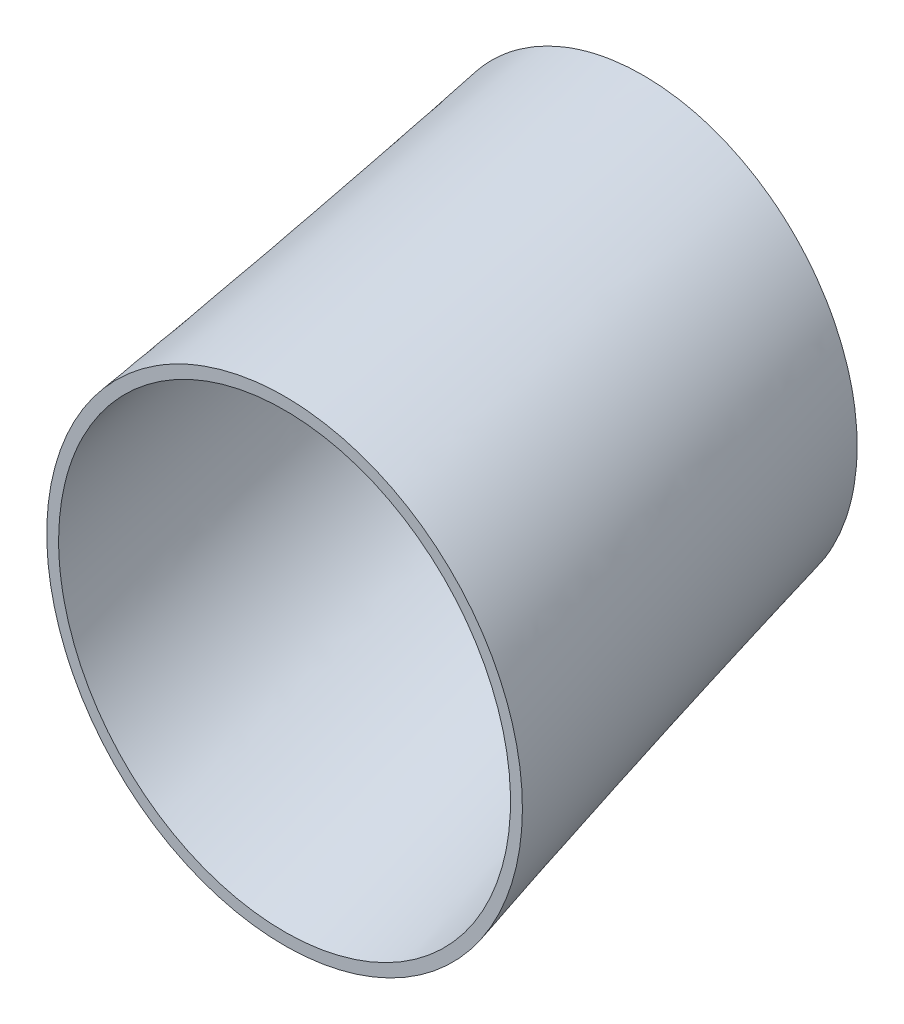
ISO-10303-21;
HEADER;
FILE_DESCRIPTION(('STEP AP214'),'2;1');
FILE_NAME('part.step','',(''),(''),'','','');
FILE_SCHEMA(('AUTOMOTIVE_DESIGN { 1 0 10303 214 1 1 1 1 }'));
ENDSEC;
DATA;
#1=APPLICATION_CONTEXT('core data for automotive mechanical design processes');
#2=APPLICATION_PROTOCOL_DEFINITION('international standard','automotive_design',2000,#1);
#3=PRODUCT_CONTEXT('',#1,'mechanical');
#4=PRODUCT('Part','Part','',(#3));
#5=PRODUCT_RELATED_PRODUCT_CATEGORY('part','',(#4));
#6=PRODUCT_DEFINITION_FORMATION('','',#4);
#7=PRODUCT_DEFINITION_CONTEXT('part definition',#1,'design');
#8=PRODUCT_DEFINITION('design','',#6,#7);
#9=PRODUCT_DEFINITION_SHAPE('','',#8);
#10=(LENGTH_UNIT() NAMED_UNIT(*) SI_UNIT(.MILLI.,.METRE.));
#11=(NAMED_UNIT(*) PLANE_ANGLE_UNIT() SI_UNIT($,.RADIAN.));
#12=(NAMED_UNIT(*) SI_UNIT($,.STERADIAN.) SOLID_ANGLE_UNIT());
#13=UNCERTAINTY_MEASURE_WITH_UNIT(LENGTH_MEASURE(1.E-05),#10,'distance_accuracy_value','');
#14=(GEOMETRIC_REPRESENTATION_CONTEXT(3) GLOBAL_UNCERTAINTY_ASSIGNED_CONTEXT((#13)) GLOBAL_UNIT_ASSIGNED_CONTEXT((#10,
#11,#12)) REPRESENTATION_CONTEXT('',''));
#15=CARTESIAN_POINT('',(0.,0.,0.));
#16=DIRECTION('',(0.,0.,1.));
#17=DIRECTION('',(1.,0.,0.));
#18=AXIS2_PLACEMENT_3D('',#15,#16,#17);
#19=CARTESIAN_POINT('',(2.8764045873989E-13,28.170605725546,0.));
#20=DIRECTION('',(0.,0.,1.));
#21=DIRECTION('',(1.,0.,0.));
#22=AXIS2_PLACEMENT_3D('',#19,#20,#21);
#23=PLANE('',#22);
#24=CARTESIAN_POINT('',(2.8764045873989E-13,28.170605725546,0.));
#25=DIRECTION('',(0.,0.,-1.));
#26=DIRECTION('',(-1.,0.,0.));
#27=AXIS2_PLACEMENT_3D('',#24,#25,#26);
#28=CIRCLE('',#27,8.5);
#29=CARTESIAN_POINT('',(8.36217269118516,26.6461163412595,0.));
#30=VERTEX_POINT('',#29);
#31=EDGE_CURVE('E139',#30,#30,#28,.T.);
#32=ORIENTED_EDGE('',*,*,#31,.F.);
#33=EDGE_LOOP('',(#32));
#34=FACE_BOUND('',#33,.T.);
#35=CARTESIAN_POINT('',(2.8764045873989E-13,28.170605725546,0.));
#36=DIRECTION('',(0.,0.,1.));
#37=DIRECTION('',(1.,0.,0.));
#38=AXIS2_PLACEMENT_3D('',#35,#36,#37);
#39=CIRCLE('',#38,9.);
#40=CARTESIAN_POINT('',(-0.079167113899448,19.170953922944,0.));
#41=VERTEX_POINT('',#40);
#42=EDGE_CURVE('E13',#41,#41,#39,.T.);
#43=ORIENTED_EDGE('',*,*,#42,.F.);
#44=EDGE_LOOP('',(#43));
#45=FACE_BOUND('',#44,.T.);
#46=ADVANCED_FACE('F70',(#34,#45),#23,.F.);
#47=CARTESIAN_POINT('',(0.500000000000292,23.5132768769378,15.5748036148368));
#48=DIRECTION('',(0.,0.,-1.));
#49=DIRECTION('',(-1.,0.,0.));
#50=AXIS2_PLACEMENT_3D('',#47,#48,#49);
#51=PLANE('',#50);
#52=CARTESIAN_POINT('',(0.500000000000292,23.5132768769378,15.5748036148368));
#53=DIRECTION('',(0.,0.,1.));
#54=DIRECTION('',(1.,0.,0.));
#55=AXIS2_PLACEMENT_3D('',#52,#53,#54);
#56=CIRCLE('',#55,9.5);
#57=CARTESIAN_POINT('',(9.92967534082972,22.3594905160575,15.5748036148368));
#58=VERTEX_POINT('',#57);
#59=EDGE_CURVE('E85',#58,#58,#56,.T.);
#60=ORIENTED_EDGE('',*,*,#59,.F.);
#61=EDGE_LOOP('',(#60));
#62=FACE_BOUND('',#61,.T.);
#63=CARTESIAN_POINT('',(0.500000000000292,23.5132768769378,15.5748036148368));
#64=DIRECTION('',(0.,0.,-1.));
#65=DIRECTION('',(-1.,0.,0.));
#66=AXIS2_PLACEMENT_3D('',#63,#64,#65);
#67=CIRCLE('',#66,10.);
#68=CARTESIAN_POINT('',(2.8283435977617,13.7881128119586,15.5748036148368));
#69=VERTEX_POINT('',#68);
#70=EDGE_CURVE('E79',#69,#69,#67,.T.);
#71=ORIENTED_EDGE('',*,*,#70,.F.);
#72=EDGE_LOOP('',(#71));
#73=FACE_BOUND('',#72,.T.);
#74=ADVANCED_FACE('F102',(#62,#73),#51,.F.);
#75=CARTESIAN_POINT('',(2.8283435977617,13.7881128119586,15.5748036148368));
#76=CARTESIAN_POINT('',(-0.079167113899448,19.170953922944,0.));
#77=CARTESIAN_POINT('',(2.42312842838756,13.6910984953852,15.5748036148368));
#78=CARTESIAN_POINT('',(-0.454152605674531,19.1742525526898,0.));
#79=CARTESIAN_POINT('',(1.98631808591908,13.6130940366696,15.5748036148368));
#80=CARTESIAN_POINT('',(-0.852603191945034,19.2010179539182,0.));
#81=CARTESIAN_POINT('',(1.04725752425121,13.5171140668681,15.5748036148368));
#82=CARTESIAN_POINT('',(-1.6936179371836,19.3211935824317,0.));
#83=CARTESIAN_POINT('',(0.544862246843895,13.4991652426862,15.5748036148368));
#84=CARTESIAN_POINT('',(-2.13630299067969,19.4146586304561,0.));
#85=CARTESIAN_POINT('',(-0.520534415529787,13.5512010916828,15.5748036148368));
#86=CARTESIAN_POINT('',(-3.05550287746433,19.6915549434238,0.));
#87=CARTESIAN_POINT('',(-1.08370650811184,13.6213116838705,15.5748036148368));
#88=CARTESIAN_POINT('',(-3.53213944978028,19.875133269326,0.));
#89=CARTESIAN_POINT('',(-2.25368474387135,13.8812302607684,15.5748036148368));
#90=CARTESIAN_POINT('',(-4.49751873928556,20.3563112881464,0.));
#91=CARTESIAN_POINT('',(-2.86061440006878,14.0713112289123,15.5748036148368));
#92=CARTESIAN_POINT('',(-4.98631002776457,20.6541762336255,0.));
#93=CARTESIAN_POINT('',(-4.08423272148748,14.6009677036828,15.5748036148368));
#94=CARTESIAN_POINT('',(-5.9399395175968,21.382592869983,0.));
#95=CARTESIAN_POINT('',(-4.70086225652519,14.9409493745797,15.5748036148368));
#96=CARTESIAN_POINT('',(-6.40463783946228,21.8134864541508,0.));
#97=CARTESIAN_POINT('',(-5.89156324707177,15.7878845711896,15.5748036148368));
#98=CARTESIAN_POINT('',(-7.26059149232606,22.8118593733683,0.));
#99=CARTESIAN_POINT('',(-6.46526004138084,16.2952230827401,15.5748036148368));
#100=CARTESIAN_POINT('',(-7.65143596379708,23.3795935581536,0.));
#101=CARTESIAN_POINT('',(-7.50541198127708,17.4693934374584,15.5748036148368));
#102=CARTESIAN_POINT('',(-8.30481273622909,24.6310640444301,0.));
#103=CARTESIAN_POINT('',(-7.9712107428854,18.1363046956592,15.5748036148368));
#104=CARTESIAN_POINT('',(-8.56675450727207,25.3147271118938,0.));
#105=CARTESIAN_POINT('',(-8.73438428879122,19.5890714674891,15.5748036148368));
#106=CARTESIAN_POINT('',(-8.91769895076796,26.749348934092,0.));
#107=CARTESIAN_POINT('',(-9.03113543183216,20.3745029404281,15.5748036148368));
#108=CARTESIAN_POINT('',(-9.00624906209332,27.4998018558955,0.));
#109=CARTESIAN_POINT('',(-9.41919269812573,21.9953636179247,15.5748036148368));
#110=CARTESIAN_POINT('',(-8.99305454311003,28.9997438229958,0.));
#111=CARTESIAN_POINT('',(-9.51031512563101,22.8300255511556,15.5748036148368));
#112=CARTESIAN_POINT('',(-8.89131615872753,29.7485228365923,0.));
#113=CARTESIAN_POINT('',(-9.48780283307224,24.47089676828,15.5748036148368));
#114=CARTESIAN_POINT('',(-8.51518814101123,31.176748830417,0.));
#115=CARTESIAN_POINT('',(-9.37453210127932,25.2764455588258,15.5748036148368));
#116=CARTESIAN_POINT('',(-8.24125989738917,31.8556980174532,0.));
#117=CARTESIAN_POINT('',(-8.97890434069419,26.7943621425101,15.5748036148368));
#118=CARTESIAN_POINT('',(-7.56596835294338,33.0954806253224,0.));
#119=CARTESIAN_POINT('',(-8.69716849303885,27.5065034832907,15.5748036148368));
#120=CARTESIAN_POINT('',(-7.16519677898618,33.65625121207,0.));
#121=CARTESIAN_POINT('',(-8.01911962384838,28.8008441676295,15.5748036148368));
#122=CARTESIAN_POINT('',(-6.29181219843573,34.6394116853063,0.));
#123=CARTESIAN_POINT('',(-7.62331499008481,29.3832170824512,15.5748036148368));
#124=CARTESIAN_POINT('',(-5.8196055044692,35.0620636099379,0.));
#125=CARTESIAN_POINT('',(-6.77223164430793,30.4095868580775,15.5748036148368));
#126=CARTESIAN_POINT('',(-4.85330927641301,35.7735912619968,0.));
#127=CARTESIAN_POINT('',(-6.31718959117013,30.8539190670142,15.5748036148368));
#128=CARTESIAN_POINT('',(-4.35935358557392,36.0628112905665,0.));
#129=CARTESIAN_POINT('',(-5.3917741471462,31.6155049090107,15.5748036148368));
#130=CARTESIAN_POINT('',(-3.38565880070635,36.5269318830028,0.));
#131=CARTESIAN_POINT('',(-4.92141426111187,31.9330578630356,15.5748036148368));
#132=CARTESIAN_POINT('',(-2.90586647657864,36.7020968039152,0.));
#133=CARTESIAN_POINT('',(-3.99509732297781,32.4619384808538,15.5748036148368));
#134=CARTESIAN_POINT('',(-1.98193767419039,36.9627796919563,0.));
#135=CARTESIAN_POINT('',(-3.53904509701081,32.6734557194922,15.5748036148368));
#136=CARTESIAN_POINT('',(-1.53767688864368,37.0484425556515,0.));
#137=CARTESIAN_POINT('',(-2.65833444146587,33.0131550487419,15.5748036148368));
#138=CARTESIAN_POINT('',(-0.694678160599266,37.1538044458813,0.));
#139=CARTESIAN_POINT('',(-2.23355876713525,33.1414266253437,15.5748036148368));
#140=CARTESIAN_POINT('',(-0.295818377875057,37.1735561578937,0.));
#141=CARTESIAN_POINT('',(-1.42312842838698,33.3354552584904,15.5748036148368));
#142=CARTESIAN_POINT('',(0.454152605675106,37.1669588984021,0.));
#143=CARTESIAN_POINT('',(-0.986318085918497,33.413459717206,15.5748036148368));
#144=CARTESIAN_POINT('',(0.852603191945605,37.1401934971737,0.));
#145=CARTESIAN_POINT('',(-0.0472575242506278,33.5094396870076,15.5748036148368));
#146=CARTESIAN_POINT('',(1.69361793718417,37.0200178686602,0.));
#147=CARTESIAN_POINT('',(0.455137753156695,33.5273885111894,15.5748036148368));
#148=CARTESIAN_POINT('',(2.13630299068027,36.9265528206358,0.));
#149=CARTESIAN_POINT('',(1.52053441553037,33.4753526621928,15.5748036148368));
#150=CARTESIAN_POINT('',(3.0555028774649,36.6496565076681,0.));
#151=CARTESIAN_POINT('',(2.08370650811243,33.4052420700051,15.5748036148368));
#152=CARTESIAN_POINT('',(3.53213944978085,36.4660781817659,0.));
#153=CARTESIAN_POINT('',(3.25368474387193,33.1453234931072,15.5748036148368));
#154=CARTESIAN_POINT('',(4.49751873928614,35.9849001629455,0.));
#155=CARTESIAN_POINT('',(3.86061440006936,32.9552425249633,15.5748036148368));
#156=CARTESIAN_POINT('',(4.98631002776515,35.6870352174664,0.));
#157=CARTESIAN_POINT('',(5.08423272148806,32.4255860501928,15.5748036148368));
#158=CARTESIAN_POINT('',(5.93993951759737,34.9586185811089,0.));
#159=CARTESIAN_POINT('',(5.70086225652577,32.0856043792959,15.5748036148368));
#160=CARTESIAN_POINT('',(6.40463783946286,34.5277249969411,0.));
#161=CARTESIAN_POINT('',(6.89156324707236,31.238669182686,15.5748036148368));
#162=CARTESIAN_POINT('',(7.26059149232663,33.5293520777237,0.));
#163=CARTESIAN_POINT('',(7.46526004138143,30.7313306711355,15.5748036148368));
#164=CARTESIAN_POINT('',(7.65143596379766,32.9616178929384,0.));
#165=CARTESIAN_POINT('',(8.50541198127766,29.5571603164172,15.5748036148368));
#166=CARTESIAN_POINT('',(8.30481273622967,31.7101474066617,0.));
#167=CARTESIAN_POINT('',(8.97121074288599,28.8902490582164,15.5748036148368));
#168=CARTESIAN_POINT('',(8.56675450727264,31.0264843391981,0.));
#169=CARTESIAN_POINT('',(9.73438428879181,27.4374822863865,15.5748036148368));
#170=CARTESIAN_POINT('',(8.91769895076853,29.5918625169999,0.));
#171=CARTESIAN_POINT('',(10.0311354318327,26.6520508134475,15.5748036148368));
#172=CARTESIAN_POINT('',(9.00624906209389,28.8414095951964,0.));
#173=CARTESIAN_POINT('',(10.4191926981263,25.0311901359509,15.5748036148368));
#174=CARTESIAN_POINT('',(8.9930545431106,27.3414676280961,0.));
#175=CARTESIAN_POINT('',(10.5103151256316,24.19652820272,15.5748036148368));
#176=CARTESIAN_POINT('',(8.8913161587281,26.5926886144996,0.));
#177=CARTESIAN_POINT('',(10.4878028330728,22.5556569855956,15.5748036148368));
#178=CARTESIAN_POINT('',(8.5151881410118,25.1644626206749,0.));
#179=CARTESIAN_POINT('',(10.3745321012799,21.7501081950498,15.5748036148368));
#180=CARTESIAN_POINT('',(8.24125989738974,24.4855134336387,0.));
#181=CARTESIAN_POINT('',(9.97890434069478,20.2321916113655,15.5748036148368));
#182=CARTESIAN_POINT('',(7.56596835294396,23.2457308257694,0.));
#183=CARTESIAN_POINT('',(9.69716849303944,19.520050270585,15.5748036148368));
#184=CARTESIAN_POINT('',(7.16519677898676,22.6849602390219,0.));
#185=CARTESIAN_POINT('',(9.01911962384897,18.2257095862461,15.5748036148368));
#186=CARTESIAN_POINT('',(6.2918121984363,21.7017997657856,0.));
#187=CARTESIAN_POINT('',(8.62331499008539,17.6433366714244,15.5748036148368));
#188=CARTESIAN_POINT('',(5.81960550446977,21.279147841154,0.));
#189=CARTESIAN_POINT('',(7.77223164430852,16.6169668957981,15.5748036148368));
#190=CARTESIAN_POINT('',(4.85330927641358,20.5676201890951,0.));
#191=CARTESIAN_POINT('',(7.31718959117071,16.1726346868614,15.5748036148368));
#192=CARTESIAN_POINT('',(4.35935358557449,20.2784001605254,0.));
#193=CARTESIAN_POINT('',(6.39177414714678,15.4110488448649,15.5748036148368));
#194=CARTESIAN_POINT('',(3.38565880070693,19.8142795680891,0.));
#195=CARTESIAN_POINT('',(5.92141426111246,15.09349589084,15.5748036148368));
#196=CARTESIAN_POINT('',(2.90586647657921,19.6391146471767,0.));
#197=CARTESIAN_POINT('',(4.9950973229784,14.5646152730218,15.5748036148368));
#198=CARTESIAN_POINT('',(1.98193767419097,19.3784317591356,0.));
#199=CARTESIAN_POINT('',(4.5390450970114,14.3530980343834,15.5748036148368));
#200=CARTESIAN_POINT('',(1.53767688864425,19.2927688954404,0.));
#201=CARTESIAN_POINT('',(3.65833444146646,14.0133987051337,15.5748036148368));
#202=CARTESIAN_POINT('',(0.69467816059984,19.1874070052106,0.));
#203=CARTESIAN_POINT('',(3.23355876713583,13.885127128532,15.5748036148368));
#204=CARTESIAN_POINT('',(0.295818377875635,19.1676552931982,0.));
#205=CARTESIAN_POINT('',(2.8283435977617,13.7881128119586,15.5748036148368));
#206=CARTESIAN_POINT('',(-0.079167113899448,19.170953922944,0.));
#207=B_SPLINE_SURFACE_WITH_KNOTS('',3,1,((#75,#76),(#77,#78),(#79,#80),(#81,#82),(#83,#84),(#85,
#86),(#87,#88),(#89,#90),(#91,#92),(#93,#94),(#95,#96),(#97,#98),(#99,#100),(#101,#102),(#103,
#104),(#105,#106),(#107,#108),(#109,#110),(#111,#112),(#113,#114),(#115,#116),(#117,#118),(#119,
#120),(#121,#122),(#123,#124),(#125,#126),(#127,#128),(#129,#130),(#131,#132),(#133,#134),(#135,
#136),(#137,#138),(#139,#140),(#141,#142),(#143,#144),(#145,#146),(#147,#148),(#149,#150),(#151,
#152),(#153,#154),(#155,#156),(#157,#158),(#159,#160),(#161,#162),(#163,#164),(#165,#166),(#167,
#168),(#169,#170),(#171,#172),(#173,#174),(#175,#176),(#177,#178),(#179,#180),(#181,#182),(#183,
#184),(#185,#186),(#187,#188),(#189,#190),(#191,#192),(#193,#194),(#195,#196),(#197,#198),(#199,
#200),(#201,#202),(#203,#204),(#205,#206)),.UNSPECIFIED.,.T.,.F.,.F.,(4,2,2,2,2,2,2,2,2,2,2,2,2,
2,2,2,2,2,2,2,2,2,2,2,2,2,2,2,2,2,2,2,4),(2,2),(0.,0.03125,0.0625000000000001,
0.0937500000000001,0.125,0.15625,0.1875,0.21875,0.25,0.28125,0.3125,0.34375,0.375,0.40625,
0.4375,0.46875,0.5,0.53125,0.5625,0.593750000000001,0.625000000000001,0.656250000000001,0.6875,
0.71875,0.75,0.78125,0.8125,0.84375,0.875,0.90625,0.9375,0.96875,1.),(0.,1.),.UNSPECIFIED.);
#208=CARTESIAN_POINT('',(2.8283435977617,13.7881128119586,15.5748036148368));
#209=CARTESIAN_POINT('',(2.79805702784856,13.8441840735313,15.4125660771822));
#210=CARTESIAN_POINT('',(2.76777045793542,13.9002553351041,15.2503285395277));
#211=CARTESIAN_POINT('',(2.70719731810915,14.0123978582496,14.9258534642186));
#212=CARTESIAN_POINT('',(2.67691074819601,14.0684691198224,14.763615926564));
#213=CARTESIAN_POINT('',(2.61633760836974,14.1806116429679,14.4391408512549));
#214=CARTESIAN_POINT('',(2.5860510384566,14.2366829045407,14.2769033136004));
#215=CARTESIAN_POINT('',(2.52547789863033,14.3488254276862,13.9524282382913));
#216=CARTESIAN_POINT('',(2.49519132871719,14.404896689259,13.7901907006367));
#217=CARTESIAN_POINT('',(2.43461818889092,14.5170392124045,13.4657156253276));
#218=CARTESIAN_POINT('',(2.40433161897778,14.5731104739773,13.3034780876731));
#219=CARTESIAN_POINT('',(2.34375847915151,14.6852529971228,12.979003012364));
#220=CARTESIAN_POINT('',(2.31347190923837,14.7413242586956,12.8167654747094));
#221=CARTESIAN_POINT('',(2.25289876941209,14.8534667818411,12.4922903994003));
#222=CARTESIAN_POINT('',(2.22261219949896,14.9095380434139,12.3300528617458));
#223=CARTESIAN_POINT('',(2.16203905967268,15.0216805665594,12.0055777864367));
#224=CARTESIAN_POINT('',(2.13175248975955,15.0777518281322,11.8433402487821));
#225=CARTESIAN_POINT('',(2.07117934993327,15.1898943512777,11.518865173473));
#226=CARTESIAN_POINT('',(2.04089278002014,15.2459656128505,11.3566276358185));
#227=CARTESIAN_POINT('',(1.98031964019386,15.358108135996,11.0321525605094));
#228=CARTESIAN_POINT('',(1.95003307028073,15.4141793975687,10.8699150228548));
#229=CARTESIAN_POINT('',(1.88945993045445,15.5263219207143,10.5454399475457));
#230=CARTESIAN_POINT('',(1.85917336054132,15.582393182287,10.3832024098912));
#231=CARTESIAN_POINT('',(1.79860022071504,15.6945357054326,10.0587273345821));
#232=CARTESIAN_POINT('',(1.7683136508019,15.7506069670053,9.89648979692753));
#233=CARTESIAN_POINT('',(1.70774051097563,15.8627494901509,9.57201472161843));
#234=CARTESIAN_POINT('',(1.67745394106249,15.9188207517236,9.40977718396388));
#235=CARTESIAN_POINT('',(1.61688080123622,16.0309632748692,9.08530210865478));
#236=CARTESIAN_POINT('',(1.58659423132308,16.0870345364419,8.92306457100023));
#237=CARTESIAN_POINT('',(1.52602109149681,16.1991770595875,8.59858949569113));
#238=CARTESIAN_POINT('',(1.49573452158367,16.2552483211602,8.43635195803659));
#239=CARTESIAN_POINT('',(1.4351613817574,16.3673908443057,8.11187688272748));
#240=CARTESIAN_POINT('',(1.40487481184426,16.4234621058785,7.94963934507294));
#241=CARTESIAN_POINT('',(1.34430167201799,16.535604629024,7.62516426976384));
#242=CARTESIAN_POINT('',(1.31401510210485,16.5916758905968,7.46292673210929));
#243=CARTESIAN_POINT('',(1.25344196227858,16.7038184137423,7.13845165680019));
#244=CARTESIAN_POINT('',(1.22315539236544,16.7598896753151,6.97621411914564));
#245=CARTESIAN_POINT('',(1.16258225253917,16.8720321984606,6.65173904383654));
#246=CARTESIAN_POINT('',(1.13229568262603,16.9281034600334,6.48950150618199));
#247=CARTESIAN_POINT('',(1.07172254279975,17.0402459831789,6.16502643087289));
#248=CARTESIAN_POINT('',(1.04143597288662,17.0963172447517,6.00278889321834));
#249=CARTESIAN_POINT('',(0.980862833060344,17.2084597678972,5.67831381790924));
#250=CARTESIAN_POINT('',(0.950576263147207,17.26453102947,5.51607628025469));
#251=CARTESIAN_POINT('',(0.890003123320933,17.3766735526155,5.19160120494559));
#252=CARTESIAN_POINT('',(0.859716553407797,17.4327448141883,5.02936366729104));
#253=CARTESIAN_POINT('',(0.799143413581523,17.5448873373338,4.70488859198194));
#254=CARTESIAN_POINT('',(0.768856843668386,17.6009585989066,4.54265105432739));
#255=CARTESIAN_POINT('',(0.708283703842112,17.7131011220521,4.21817597901829));
#256=CARTESIAN_POINT('',(0.677997133928975,17.7691723836249,4.05593844136374));
#257=CARTESIAN_POINT('',(0.617423994102701,17.8813149067704,3.73146336605464));
#258=CARTESIAN_POINT('',(0.587137424189564,17.9373861683432,3.56922582840009));
#259=CARTESIAN_POINT('',(0.52656428436329,18.0495286914887,3.24475075309099));
#260=CARTESIAN_POINT('',(0.496277714450153,18.1055999530615,3.08251321543644));
#261=CARTESIAN_POINT('',(0.435704574623879,18.217742476207,2.75803814012734));
#262=CARTESIAN_POINT('',(0.405418004710743,18.2738137377798,2.5958006024728));
#263=CARTESIAN_POINT('',(0.344844864884469,18.3859562609253,2.2713255271637));
#264=CARTESIAN_POINT('',(0.314558294971332,18.4420275224981,2.10908798950915));
#265=CARTESIAN_POINT('',(0.253985155145058,18.5541700456436,1.78461291420005));
#266=CARTESIAN_POINT('',(0.223698585231921,18.6102413072163,1.6223753765455));
#267=CARTESIAN_POINT('',(0.163125445405647,18.7223838303619,1.2979003012364));
#268=CARTESIAN_POINT('',(0.13283887549251,18.7784550919346,1.13566276358185));
#269=CARTESIAN_POINT('',(0.0722657356662367,18.8905976150802,0.811187688272749));
#270=CARTESIAN_POINT('',(0.0419791657530997,18.9466688766529,0.648950150618199));
#271=CARTESIAN_POINT('',(-0.0185939740731743,19.0588113997985,0.324475075309099));
#272=CARTESIAN_POINT('',(-0.0488805439863113,19.1148826613712,0.162237537654549));
#273=CARTESIAN_POINT('',(-0.079167113899448,19.170953922944,0.));
#274=B_SPLINE_CURVE_WITH_KNOTS('',3,(#208,#209,#210,#211,#212,#213,#214,#215,#216,#217,#218,
#219,#220,#221,#222,#223,#224,#225,#226,#227,#228,#229,#230,#231,#232,#233,#234,#235,#236,#237,
#238,#239,#240,#241,#242,#243,#244,#245,#246,#247,#248,#249,#250,#251,#252,#253,#254,#255,#256,
#257,#258,#259,#260,#261,#262,#263,#264,#265,#266,#267,#268,#269,#270,#271,#272,#273),
.UNSPECIFIED.,.F.,.F.,(4,2,2,2,2,2,2,2,2,2,2,2,2,2,2,2,2,2,2,2,2,2,2,2,2,2,2,2,2,2,2,2,4),(0.,
0.522915415570325,1.04583083114065,1.56874624671097,2.0916616622813,2.61457707785163,
3.13749249342195,3.66040790899227,4.1833233245626,4.70623874013292,5.22915415570325,
5.75206957127358,6.2749849868439,6.79790040241422,7.32081581798455,7.84373123355487,
8.3666466491252,8.88956206469552,9.41247748026585,9.93539289583617,10.4583083114065,
10.9812237269768,11.5041391425471,12.0270545581175,12.5499699736878,13.0728853892581,
13.5958008048284,14.1187162203988,14.6416316359691,15.1645470515394,15.6874624671098,
16.2103778826801,16.7332932982504),.UNSPECIFIED.);
#275=EDGE_CURVE('BSEAM111',#69,#41,#274,.T.);
#276=ORIENTED_EDGE('',*,*,#70,.T.);
#277=ORIENTED_EDGE('',*,*,#42,.T.);
#278=ORIENTED_EDGE('',*,*,#275,.T.);
#279=ORIENTED_EDGE('',*,*,#275,.F.);
#280=EDGE_LOOP('',(#276,#278,#277,#279));
#281=FACE_BOUND('',#280,.T.);
#282=ADVANCED_FACE('F111',(#281),#207,.T.);
#283=CARTESIAN_POINT('',(8.36217269118516,26.6461163412595,0.));
#284=CARTESIAN_POINT('',(9.92967534082972,22.3594905160575,15.5748036148368));
#285=CARTESIAN_POINT('',(8.42569308219709,26.9945402033922,0.));
#286=CARTESIAN_POINT('',(9.97774977253307,22.7523936552587,15.5748036148368));
#287=CARTESIAN_POINT('',(8.47219624004174,27.3696827106544,0.));
#288=CARTESIAN_POINT('',(10.004488837779,23.1730793052364,15.5748036148368));
#289=CARTESIAN_POINT('',(8.51003173236863,28.171210269076,0.));
#290=CARTESIAN_POINT('',(9.99427989825874,24.0697763547249,15.5748036148368));
#291=CARTESIAN_POINT('',(8.50136406685087,28.5975953202354,0.));
#292=CARTESIAN_POINT('',(9.95729113165569,24.545921812152,15.5748036148368));
#293=CARTESIAN_POINT('',(8.40772155542507,29.4994132200901,0.));
#294=CARTESIAN_POINT('',(9.79380588483039,25.5459803196979,15.5748036148368));
#295=CARTESIAN_POINT('',(8.32206228126512,29.9741384682316,0.));
#296=CARTESIAN_POINT('',(9.66717222264533,26.0700409862759,15.5748036148368));
#297=CARTESIAN_POINT('',(8.04712651158849,30.9550636393389,0.));
#298=CARTESIAN_POINT('',(9.29623666141562,27.1464999456204,15.5748036148368));
#299=CARTESIAN_POINT('',(7.85761259067216,31.4613557139264,0.));
#300=CARTESIAN_POINT('',(9.05166383024492,27.6989855201184,15.5748036148368));
#301=CARTESIAN_POINT('',(7.35125097636791,32.475279951729,0.));
#302=CARTESIAN_POINT('',(8.42036034813914,28.797120465344,15.5748036148368));
#303=CARTESIAN_POINT('',(7.03406130509668,32.9828430666794,0.));
#304=CARTESIAN_POINT('',(8.033252659935,29.3426704214042,15.5748036148368));
#305=CARTESIAN_POINT('',(6.25994431990737,33.9540946191911,0.));
#306=CARTESIAN_POINT('',(7.10599846905819,30.3756750700978,15.5748036148368));
#307=CARTESIAN_POINT('',(5.80270765646679,34.4174471912812,0.));
#308=CARTESIAN_POINT('',(6.56552879127302,30.8627347868986,15.5748036148368));
#309=CARTESIAN_POINT('',(4.75784790750733,35.2457260590438,0.));
#310=CARTESIAN_POINT('',(5.34555334282643,31.718505934671,15.5748036148368));
#311=CARTESIAN_POINT('',(4.17018790317918,35.6100915735877,0.));
#312=CARTESIAN_POINT('',(4.66604307234532,32.0865892696103,15.5748036148368));
#313=CARTESIAN_POINT('',(2.90173807432915,36.1903521666139,0.));
#314=CARTESIAN_POINT('',(3.21282911807776,32.6510095519013,15.5748036148368));
#315=CARTESIAN_POINT('',(2.22133710855211,36.405737634707,0.));
#316=CARTESIAN_POINT('',(2.43959263928307,32.8468033543605,15.5748036148368));
#317=CARTESIAN_POINT('',(0.827641660021297,36.6598191987547,0.));
#318=CARTESIAN_POINT('',(0.867980082478165,33.0391010811739,15.5748036148368));
#319=CARTESIAN_POINT('',(0.115006914757961,36.6983950194128,0.));
#320=CARTESIAN_POINT('',(0.0703479630747258,33.0355139770184,15.5748036148368));
#321=CARTESIAN_POINT('',(-1.27660481780089,36.60308442224,0.));
#322=CARTESIAN_POINT('',(-1.47607918516061,32.8381206459754,15.5748036148368));
#323=CARTESIAN_POINT('',(-1.95503812832274,36.4695376062911,0.));
#324=CARTESIAN_POINT('',(-2.22428983735498,32.6447288956545,15.5748036148368));
#325=CARTESIAN_POINT('',(-3.22496666758054,36.0632627203378,0.));
#326=CARTESIAN_POINT('',(-3.61460514069509,32.1083449758074,15.5748036148368));
#327=CARTESIAN_POINT('',(-3.81629854760907,35.7910723823045,0.));
#328=CARTESIAN_POINT('',(-4.25656272226839,31.7659634579128,15.5748036148368));
#329=CARTESIAN_POINT('',(-4.88335550831147,35.1554812184016,0.));
#330=CARTESIAN_POINT('',(-5.40552403146786,30.9869982156306,15.5748036148368));
#331=CARTESIAN_POINT('',(-5.35925151423309,34.7925038158444,0.));
#332=CARTESIAN_POINT('',(-5.9127461699216,30.5508757338821,15.5748036148368));
#333=CARTESIAN_POINT('',(-6.19083753051843,34.0224978795276,0.));
#334=CARTESIAN_POINT('',(-6.79019074234852,29.6373466063974,15.5748036148368));
#335=CARTESIAN_POINT('',(-6.54682315170398,33.6156546314327,0.));
#336=CARTESIAN_POINT('',(-7.16075512139285,29.1601273478183,15.5748036148368));
#337=CARTESIAN_POINT('',(-7.15022694509589,32.7948576218866,0.));
#338=CARTESIAN_POINT('',(-7.78028665820255,28.2048589265691,15.5748036148368));
#339=CARTESIAN_POINT('',(-7.39789978727317,32.3809014216427,0.));
#340=CARTESIAN_POINT('',(-8.02953779938268,27.7267903799431,15.5748036148368));
#341=CARTESIAN_POINT('',(-7.8037577246008,31.5701463543427,0.));
#342=CARTESIAN_POINT('',(-8.42931849291626,26.7956513776872,15.5748036148368));
#343=CARTESIAN_POINT('',(-7.96233351290672,31.174251090869,0.));
#344=CARTESIAN_POINT('',(-8.58001677121747,26.3424707355583,15.5748036148368));
#345=CARTESIAN_POINT('',(-8.20978080069265,30.4109373996802,0.));
#346=CARTESIAN_POINT('',(-8.80612203868799,25.4746883728489,15.5748036148368));
#347=CARTESIAN_POINT('',(-8.29865230017264,30.0435189719651,0.));
#348=CARTESIAN_POINT('',(-8.88160090912578,25.0599663770193,15.5748036148368));
#349=CARTESIAN_POINT('',(-8.42569308219651,29.3466712476997,0.));
#350=CARTESIAN_POINT('',(-8.97774977253249,24.2741600986169,15.5748036148368));
#351=CARTESIAN_POINT('',(-8.47219624004116,28.9715287404376,0.));
#352=CARTESIAN_POINT('',(-9.00448883777843,23.8534744486392,15.5748036148368));
#353=CARTESIAN_POINT('',(-8.51003173236806,28.170001182016,0.));
#354=CARTESIAN_POINT('',(-8.99427989825816,22.9567773991507,15.5748036148368));
#355=CARTESIAN_POINT('',(-8.50136406685029,27.7436161308565,0.));
#356=CARTESIAN_POINT('',(-8.9572911316551,22.4806319417236,15.5748036148368));
#357=CARTESIAN_POINT('',(-8.40772155542449,26.8417982310018,0.));
#358=CARTESIAN_POINT('',(-8.7938058848298,21.4805734341777,15.5748036148368));
#359=CARTESIAN_POINT('',(-8.32206228126454,26.3670729828603,0.));
#360=CARTESIAN_POINT('',(-8.66717222264475,20.9565127675997,15.5748036148368));
#361=CARTESIAN_POINT('',(-8.04712651158793,25.386147811753,0.));
#362=CARTESIAN_POINT('',(-8.29623666141505,19.8800538082552,15.5748036148368));
#363=CARTESIAN_POINT('',(-7.85761259067158,24.8798557371655,0.));
#364=CARTESIAN_POINT('',(-8.05166383024434,19.3275682337572,15.5748036148368));
#365=CARTESIAN_POINT('',(-7.35125097636734,23.8659314993629,0.));
#366=CARTESIAN_POINT('',(-7.42036034813855,18.2294332885316,15.5748036148368));
#367=CARTESIAN_POINT('',(-7.03406130509611,23.3583683844125,0.));
#368=CARTESIAN_POINT('',(-7.03325265993443,17.6838833324714,15.5748036148368));
#369=CARTESIAN_POINT('',(-6.25994431990679,22.3871168319008,0.));
#370=CARTESIAN_POINT('',(-6.10599846905761,16.6508786837778,15.5748036148368));
#371=CARTESIAN_POINT('',(-5.80270765646622,21.9237642598107,0.));
#372=CARTESIAN_POINT('',(-5.56552879127243,16.163818966977,15.5748036148368));
#373=CARTESIAN_POINT('',(-4.75784790750676,21.0954853920481,0.));
#374=CARTESIAN_POINT('',(-4.34555334282585,15.3080478192046,15.5748036148368));
#375=CARTESIAN_POINT('',(-4.17018790317861,20.7311198775043,0.));
#376=CARTESIAN_POINT('',(-3.66604307234475,14.9399644842654,15.5748036148368));
#377=CARTESIAN_POINT('',(-2.90173807432858,20.150859284478,0.));
#378=CARTESIAN_POINT('',(-2.21282911807718,14.3755442019743,15.5748036148368));
#379=CARTESIAN_POINT('',(-2.22133710855153,19.935473816385,0.));
#380=CARTESIAN_POINT('',(-1.43959263928248,14.1797503995151,15.5748036148368));
#381=CARTESIAN_POINT('',(-0.827641660020723,19.6813922523372,0.));
#382=CARTESIAN_POINT('',(0.132019917522413,13.9874526727017,15.5748036148368));
#383=CARTESIAN_POINT('',(-0.11500691475739,19.6428164316791,0.));
#384=CARTESIAN_POINT('',(0.929652036925855,13.9910397768572,15.5748036148368));
#385=CARTESIAN_POINT('',(1.27660481780146,19.7381270288519,0.));
#386=CARTESIAN_POINT('',(2.47607918516119,14.1884331079002,15.5748036148368));
#387=CARTESIAN_POINT('',(1.95503812832331,19.8716738448008,0.));
#388=CARTESIAN_POINT('',(3.22428983735556,14.3818248582211,15.5748036148368));
#389=CARTESIAN_POINT('',(3.22496666758111,20.2779487307541,0.));
#390=CARTESIAN_POINT('',(4.61460514069566,14.9182087780682,15.5748036148368));
#391=CARTESIAN_POINT('',(3.81629854760965,20.5501390687874,0.));
#392=CARTESIAN_POINT('',(5.25656272226898,15.2605902959628,15.5748036148368));
#393=CARTESIAN_POINT('',(4.88335550831205,21.1857302326903,0.));
#394=CARTESIAN_POINT('',(6.40552403146844,16.039555538245,15.5748036148368));
#395=CARTESIAN_POINT('',(5.35925151423367,21.5487076352475,0.));
#396=CARTESIAN_POINT('',(6.91274616992217,16.4756780199935,15.5748036148368));
#397=CARTESIAN_POINT('',(6.190837530519,22.3187135715643,0.));
#398=CARTESIAN_POINT('',(7.7901907423491,17.3892071474782,15.5748036148368));
#399=CARTESIAN_POINT('',(6.54682315170455,22.7255568196592,0.));
#400=CARTESIAN_POINT('',(8.16075512139344,17.8664264060573,15.5748036148368));
#401=CARTESIAN_POINT('',(7.15022694509646,23.5463538292052,0.));
#402=CARTESIAN_POINT('',(8.78028665820313,18.8216948273065,15.5748036148368));
#403=CARTESIAN_POINT('',(7.39789978727374,23.9603100294492,0.));
#404=CARTESIAN_POINT('',(9.02953779938326,19.2997633739325,15.5748036148368));
#405=CARTESIAN_POINT('',(7.80375772460139,24.7710650967492,0.));
#406=CARTESIAN_POINT('',(9.42931849291684,20.2309023761884,15.5748036148368));
#407=CARTESIAN_POINT('',(7.96233351290732,25.1669603602229,0.));
#408=CARTESIAN_POINT('',(9.58001677121805,20.6840830183173,15.5748036148368));
#409=CARTESIAN_POINT('',(8.20978080069324,25.9302740514118,0.));
#410=CARTESIAN_POINT('',(9.80612203868857,21.5518653810267,15.5748036148368));
#411=CARTESIAN_POINT('',(8.29865230017323,26.2976924791268,0.));
#412=CARTESIAN_POINT('',(9.88160090912638,21.9665873768563,15.5748036148368));
#413=CARTESIAN_POINT('',(8.36217269118516,26.6461163412595,0.));
#414=CARTESIAN_POINT('',(9.92967534082972,22.3594905160575,15.5748036148368));
#415=B_SPLINE_SURFACE_WITH_KNOTS('',3,1,((#283,#284),(#285,#286),(#287,#288),(#289,#290),(#291,
#292),(#293,#294),(#295,#296),(#297,#298),(#299,#300),(#301,#302),(#303,#304),(#305,#306),(#307,
#308),(#309,#310),(#311,#312),(#313,#314),(#315,#316),(#317,#318),(#319,#320),(#321,#322),(#323,
#324),(#325,#326),(#327,#328),(#329,#330),(#331,#332),(#333,#334),(#335,#336),(#337,#338),(#339,
#340),(#341,#342),(#343,#344),(#345,#346),(#347,#348),(#349,#350),(#351,#352),(#353,#354),(#355,
#356),(#357,#358),(#359,#360),(#361,#362),(#363,#364),(#365,#366),(#367,#368),(#369,#370),(#371,
#372),(#373,#374),(#375,#376),(#377,#378),(#379,#380),(#381,#382),(#383,#384),(#385,#386),(#387,
#388),(#389,#390),(#391,#392),(#393,#394),(#395,#396),(#397,#398),(#399,#400),(#401,#402),(#403,
#404),(#405,#406),(#407,#408),(#409,#410),(#411,#412),(#413,#414)),.UNSPECIFIED.,.T.,.F.,.F.,(4,
2,2,2,2,2,2,2,2,2,2,2,2,2,2,2,2,2,2,2,2,2,2,2,2,2,2,2,2,2,2,2,4),(2,2),(0.,0.0312499999999999,
0.0625000000000005,0.0937500000000007,0.125000000000001,0.156250000000001,0.187500000000001,
0.218750000000001,0.250000000000001,0.281250000000002,0.312500000000002,0.343750000000002,
0.375000000000002,0.406250000000002,0.437500000000002,0.468749999999999,0.500000000000002,
0.531249999999999,0.562500000000002,0.593750000000002,0.625000000000002,0.656250000000002,
0.687500000000001,0.718750000000001,0.750000000000001,0.781250000000001,0.812500000000001,
0.843750000000001,0.875000000000001,0.906250000000001,0.9375,0.96875,1.),(0.,1.),.UNSPECIFIED.);
#416=CARTESIAN_POINT('',(8.36217269118516,26.6461163412595,0.));
#417=CARTESIAN_POINT('',(8.37850084378562,26.6014639889137,0.16223753765455));
#418=CARTESIAN_POINT('',(8.39482899638609,26.5568116365678,0.3244750753091));
#419=CARTESIAN_POINT('',(8.42748530158702,26.4675069318761,0.648950150618199));
#420=CARTESIAN_POINT('',(8.44381345418748,26.4228545795303,0.811187688272749));
#421=CARTESIAN_POINT('',(8.47646975938841,26.3335498748386,1.13566276358185));
#422=CARTESIAN_POINT('',(8.49279791198888,26.2888975224927,1.2979003012364));
#423=CARTESIAN_POINT('',(8.5254542171898,26.199592817801,1.6223753765455));
#424=CARTESIAN_POINT('',(8.54178236979027,26.1549404654551,1.78461291420005));
#425=CARTESIAN_POINT('',(8.5744386749912,26.0656357607634,2.10908798950915));
#426=CARTESIAN_POINT('',(8.59076682759166,26.0209834084176,2.2713255271637));
#427=CARTESIAN_POINT('',(8.62342313279259,25.9316787037259,2.5958006024728));
#428=CARTESIAN_POINT('',(8.63975128539305,25.88702635138,2.75803814012735));
#429=CARTESIAN_POINT('',(8.67240759059398,25.7977216466883,3.08251321543645));
#430=CARTESIAN_POINT('',(8.68873574319444,25.7530692943424,3.244750753091));
#431=CARTESIAN_POINT('',(8.72139204839537,25.6637645896507,3.56922582840009));
#432=CARTESIAN_POINT('',(8.73772020099584,25.6191122373049,3.73146336605464));
#433=CARTESIAN_POINT('',(8.77037650619677,25.5298075326132,4.05593844136374));
#434=CARTESIAN_POINT('',(8.78670465879723,25.4851551802673,4.21817597901829));
#435=CARTESIAN_POINT('',(8.81936096399816,25.3958504755756,4.54265105432739));
#436=CARTESIAN_POINT('',(8.83568911659862,25.3511981232297,4.70488859198194));
#437=CARTESIAN_POINT('',(8.86834542179955,25.261893418538,5.02936366729104));
#438=CARTESIAN_POINT('',(8.88467357440001,25.2172410661922,5.19160120494559));
#439=CARTESIAN_POINT('',(8.91732987960094,25.1279363615005,5.51607628025469));
#440=CARTESIAN_POINT('',(8.93365803220141,25.0832840091546,5.67831381790924));
#441=CARTESIAN_POINT('',(8.96631433740234,24.9939793044629,6.00278889321834));
#442=CARTESIAN_POINT('',(8.9826424900028,24.9493269521171,6.16502643087289));
#443=CARTESIAN_POINT('',(9.01529879520373,24.8600222474253,6.48950150618199));
#444=CARTESIAN_POINT('',(9.03162694780419,24.8153698950795,6.65173904383654));
#445=CARTESIAN_POINT('',(9.06428325300512,24.7260651903878,6.97621411914564));
#446=CARTESIAN_POINT('',(9.08061140560558,24.6814128380419,7.13845165680019));
#447=CARTESIAN_POINT('',(9.11326771080651,24.5921081333502,7.46292673210929));
#448=CARTESIAN_POINT('',(9.12959586340698,24.5474557810044,7.62516426976384));
#449=CARTESIAN_POINT('',(9.16225216860791,24.4581510763127,7.94963934507294));
#450=CARTESIAN_POINT('',(9.17858032120837,24.4134987239668,8.11187688272749));
#451=CARTESIAN_POINT('',(9.2112366264093,24.3241940192751,8.43635195803659));
#452=CARTESIAN_POINT('',(9.22756477900977,24.2795416669292,8.59858949569114));
#453=CARTESIAN_POINT('',(9.26022108421069,24.1902369622375,8.92306457100024));
#454=CARTESIAN_POINT('',(9.27654923681116,24.1455846098917,9.08530210865479));
#455=CARTESIAN_POINT('',(9.30920554201208,24.0562799052,9.40977718396389));
#456=CARTESIAN_POINT('',(9.32553369461255,24.0116275528541,9.57201472161843));
#457=CARTESIAN_POINT('',(9.35818999981348,23.9223228481624,9.89648979692753));
#458=CARTESIAN_POINT('',(9.37451815241394,23.8776704958165,10.0587273345821));
#459=CARTESIAN_POINT('',(9.40717445761487,23.7883657911248,10.3832024098912));
#460=CARTESIAN_POINT('',(9.42350261021533,23.743713438779,10.5454399475457));
#461=CARTESIAN_POINT('',(9.45615891541626,23.6544087340873,10.8699150228548));
#462=CARTESIAN_POINT('',(9.47248706801672,23.6097563817414,11.0321525605094));
#463=CARTESIAN_POINT('',(9.50514337321765,23.5204516770497,11.3566276358185));
#464=CARTESIAN_POINT('',(9.52147152581812,23.4757993247038,11.518865173473));
#465=CARTESIAN_POINT('',(9.55412783101905,23.3864946200121,11.8433402487821));
#466=CARTESIAN_POINT('',(9.57045598361951,23.3418422676663,12.0055777864367));
#467=CARTESIAN_POINT('',(9.60311228882044,23.2525375629746,12.3300528617458));
#468=CARTESIAN_POINT('',(9.6194404414209,23.2078852106287,12.4922903994003));
#469=CARTESIAN_POINT('',(9.65209674662183,23.118580505937,12.8167654747094));
#470=CARTESIAN_POINT('',(9.6684248992223,23.0739281535912,12.979003012364));
#471=CARTESIAN_POINT('',(9.70108120442323,22.9846234488994,13.3034780876731));
#472=CARTESIAN_POINT('',(9.71740935702369,22.9399710965536,13.4657156253276));
#473=CARTESIAN_POINT('',(9.75006566222462,22.8506663918619,13.7901907006367));
#474=CARTESIAN_POINT('',(9.76639381482508,22.806014039516,13.9524282382913));
#475=CARTESIAN_POINT('',(9.79905012002601,22.7167093348243,14.2769033136004));
#476=CARTESIAN_POINT('',(9.81537827262648,22.6720569824785,14.4391408512549));
#477=CARTESIAN_POINT('',(9.8480345778274,22.5827522777868,14.763615926564));
#478=CARTESIAN_POINT('',(9.86436273042787,22.5380999254409,14.9258534642186));
#479=CARTESIAN_POINT('',(9.8970190356288,22.4487952207492,15.2503285395277));
#480=CARTESIAN_POINT('',(9.91334718822926,22.4041428684033,15.4125660771822));
#481=CARTESIAN_POINT('',(9.92967534082972,22.3594905160575,15.5748036148368));
#482=B_SPLINE_CURVE_WITH_KNOTS('',3,(#416,#417,#418,#419,#420,#421,#422,#423,#424,#425,#426,
#427,#428,#429,#430,#431,#432,#433,#434,#435,#436,#437,#438,#439,#440,#441,#442,#443,#444,#445,
#446,#447,#448,#449,#450,#451,#452,#453,#454,#455,#456,#457,#458,#459,#460,#461,#462,#463,#464,
#465,#466,#467,#468,#469,#470,#471,#472,#473,#474,#475,#476,#477,#478,#479,#480,#481),
.UNSPECIFIED.,.F.,.F.,(4,2,2,2,2,2,2,2,2,2,2,2,2,2,2,2,2,2,2,2,2,2,2,2,2,2,2,2,2,2,2,2,4),(0.,
0.507181563006942,1.01436312601388,1.52154468902083,2.02872625202777,2.53590781503471,
3.04308937804165,3.55027094104859,4.05745250405554,4.56463406706248,5.07181563006942,
5.57899719307636,6.0861787560833,6.59336031909025,7.10054188209719,7.60772344510413,
8.11490500811107,8.62208657111801,9.12926813412496,9.6364496971319,10.1436312601388,
10.6508128231458,11.1579943861527,11.6651759491597,12.1723575121666,12.6795390751736,
13.1867206381805,13.6939022011874,14.2010837641944,14.7082653272013,15.2154468902083,
15.7226284532152,16.2298100162221),.UNSPECIFIED.);
#483=EDGE_CURVE('BSEAM112',#30,#58,#482,.T.);
#484=ORIENTED_EDGE('',*,*,#31,.T.);
#485=ORIENTED_EDGE('',*,*,#59,.T.);
#486=ORIENTED_EDGE('',*,*,#483,.T.);
#487=ORIENTED_EDGE('',*,*,#483,.F.);
#488=EDGE_LOOP('',(#484,#486,#485,#487));
#489=FACE_BOUND('',#488,.T.);
#490=ADVANCED_FACE('F112',(#489),#415,.F.);
#491=CLOSED_SHELL('',(#46,#74,#282,#490));
#492=MANIFOLD_SOLID_BREP('B2',#491);
#493=ADVANCED_BREP_SHAPE_REPRESENTATION('',(#18,#492),#14);
#494=SHAPE_DEFINITION_REPRESENTATION(#9,#493);
ENDSEC;
END-ISO-10303-21;
